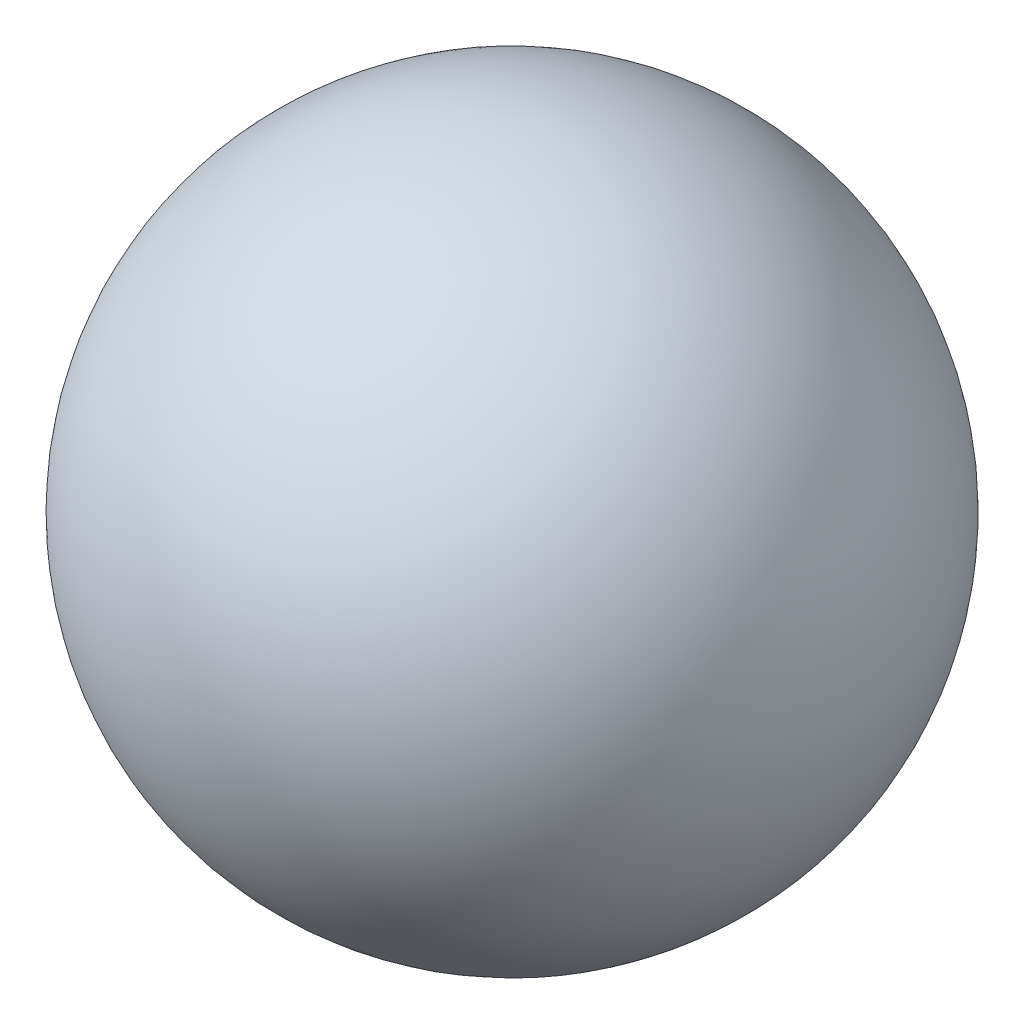
ISO-10303-21;
HEADER;
FILE_DESCRIPTION(('STEP AP214'),'2;1');
FILE_NAME('part.step','',(''),(''),'','','');
FILE_SCHEMA(('AUTOMOTIVE_DESIGN { 1 0 10303 214 1 1 1 1 }'));
ENDSEC;
DATA;
#1=APPLICATION_CONTEXT('core data for automotive mechanical design processes');
#2=APPLICATION_PROTOCOL_DEFINITION('international standard','automotive_design',2000,#1);
#3=PRODUCT_CONTEXT('',#1,'mechanical');
#4=PRODUCT('Part','Part','',(#3));
#5=PRODUCT_RELATED_PRODUCT_CATEGORY('part','',(#4));
#6=PRODUCT_DEFINITION_FORMATION('','',#4);
#7=PRODUCT_DEFINITION_CONTEXT('part definition',#1,'design');
#8=PRODUCT_DEFINITION('design','',#6,#7);
#9=PRODUCT_DEFINITION_SHAPE('','',#8);
#10=(LENGTH_UNIT() NAMED_UNIT(*) SI_UNIT(.MILLI.,.METRE.));
#11=(NAMED_UNIT(*) PLANE_ANGLE_UNIT() SI_UNIT($,.RADIAN.));
#12=(NAMED_UNIT(*) SI_UNIT($,.STERADIAN.) SOLID_ANGLE_UNIT());
#13=UNCERTAINTY_MEASURE_WITH_UNIT(LENGTH_MEASURE(1.E-05),#10,'distance_accuracy_value','');
#14=(GEOMETRIC_REPRESENTATION_CONTEXT(3) GLOBAL_UNCERTAINTY_ASSIGNED_CONTEXT((#13)) GLOBAL_UNIT_ASSIGNED_CONTEXT((#10,
#11,#12)) REPRESENTATION_CONTEXT('',''));
#15=CARTESIAN_POINT('',(0.,0.,0.));
#16=DIRECTION('',(0.,0.,1.));
#17=DIRECTION('',(1.,0.,0.));
#18=AXIS2_PLACEMENT_3D('',#15,#16,#17);
#19=CARTESIAN_POINT('',(57.535,57.796704385746,21.1108136839082));
#20=DIRECTION('',(0.,0.939302704886863,0.343089534367085));
#21=DIRECTION('',(0.173648177666933,-0.337877233422054,0.92503258619792));
#22=AXIS2_PLACEMENT_3D('',#19,#20,#21);
#23=SPHERICAL_SURFACE('',#22,6.75);
#24=CARTESIAN_POINT('',(57.535,64.1369976437323,23.426668040886));
#25=VERTEX_POINT('',#24);
#26=VERTEX_LOOP('',#25);
#27=FACE_BOUND('',#26,.T.);
#28=CARTESIAN_POINT('',(57.535,51.4564111277597,18.7949593269304));
#29=VERTEX_POINT('',#28);
#30=VERTEX_LOOP('',#29);
#31=FACE_BOUND('',#30,.T.);
#32=ADVANCED_FACE('F16',(#27,#31),#23,.T.);
#33=CLOSED_SHELL('',(#32));
#34=MANIFOLD_SOLID_BREP('B1',#33);
#35=ADVANCED_BREP_SHAPE_REPRESENTATION('',(#18,#34),#14);
#36=SHAPE_DEFINITION_REPRESENTATION(#9,#35);
ENDSEC;
END-ISO-10303-21;
